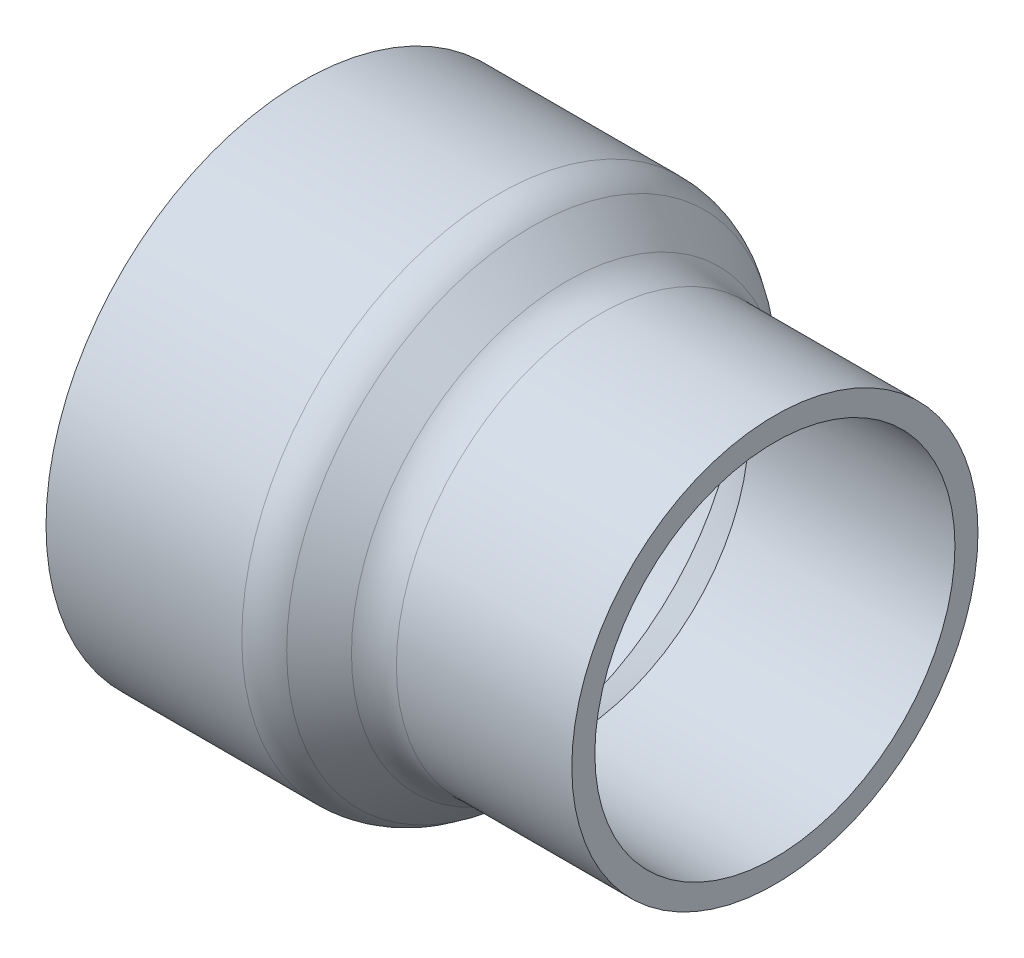
ISO-10303-21;
HEADER;
FILE_DESCRIPTION(('STEP AP214'),'2;1');
FILE_NAME('part.step','',(''),(''),'','','');
FILE_SCHEMA(('AUTOMOTIVE_DESIGN { 1 0 10303 214 1 1 1 1 }'));
ENDSEC;
DATA;
#1=APPLICATION_CONTEXT('core data for automotive mechanical design processes');
#2=APPLICATION_PROTOCOL_DEFINITION('international standard','automotive_design',2000,#1);
#3=PRODUCT_CONTEXT('',#1,'mechanical');
#4=PRODUCT('Part','Part','',(#3));
#5=PRODUCT_RELATED_PRODUCT_CATEGORY('part','',(#4));
#6=PRODUCT_DEFINITION_FORMATION('','',#4);
#7=PRODUCT_DEFINITION_CONTEXT('part definition',#1,'design');
#8=PRODUCT_DEFINITION('design','',#6,#7);
#9=PRODUCT_DEFINITION_SHAPE('','',#8);
#10=(LENGTH_UNIT() NAMED_UNIT(*) SI_UNIT(.MILLI.,.METRE.));
#11=(NAMED_UNIT(*) PLANE_ANGLE_UNIT() SI_UNIT($,.RADIAN.));
#12=(NAMED_UNIT(*) SI_UNIT($,.STERADIAN.) SOLID_ANGLE_UNIT());
#13=UNCERTAINTY_MEASURE_WITH_UNIT(LENGTH_MEASURE(1.E-05),#10,'distance_accuracy_value','');
#14=(GEOMETRIC_REPRESENTATION_CONTEXT(3) GLOBAL_UNCERTAINTY_ASSIGNED_CONTEXT((#13)) GLOBAL_UNIT_ASSIGNED_CONTEXT((#10,
#11,#12)) REPRESENTATION_CONTEXT('',''));
#15=CARTESIAN_POINT('',(0.,0.,0.));
#16=DIRECTION('',(0.,0.,1.));
#17=DIRECTION('',(1.,0.,0.));
#18=AXIS2_PLACEMENT_3D('',#15,#16,#17);
#19=CARTESIAN_POINT('',(-58.5597,0.,0.));
#20=DIRECTION('',(-1.,0.,0.));
#21=DIRECTION('',(0.,0.,1.));
#22=AXIS2_PLACEMENT_3D('',#19,#20,#21);
#23=CYLINDRICAL_SURFACE('',#22,63.6397);
#24=CARTESIAN_POINT('',(-10.0039202483172,0.,0.));
#25=DIRECTION('',(1.,0.,0.));
#26=DIRECTION('',(0.,0.,-1.));
#27=AXIS2_PLACEMENT_3D('',#24,#25,#26);
#28=CIRCLE('',#27,63.6397);
#29=CARTESIAN_POINT('',(-10.0039202483172,0.,-63.6397));
#30=VERTEX_POINT('',#29);
#31=EDGE_CURVE('E50',#30,#30,#28,.F.);
#32=ORIENTED_EDGE('',*,*,#31,.T.);
#33=EDGE_LOOP('',(#32));
#34=FACE_BOUND('',#33,.T.);
#35=CARTESIAN_POINT('',(-58.5597,0.,0.));
#36=DIRECTION('',(-1.,0.,0.));
#37=DIRECTION('',(0.,0.,1.));
#38=AXIS2_PLACEMENT_3D('',#35,#36,#37);
#39=CIRCLE('',#38,63.6397);
#40=CARTESIAN_POINT('',(-58.5597,0.,63.6397));
#41=VERTEX_POINT('',#40);
#42=EDGE_CURVE('E55',#41,#41,#39,.T.);
#43=ORIENTED_EDGE('',*,*,#42,.F.);
#44=EDGE_LOOP('',(#43));
#45=FACE_BOUND('',#44,.T.);
#46=ADVANCED_FACE('F35',(#34,#45),#23,.T.);
#47=CARTESIAN_POINT('',(-58.5597,-63.6397,0.));
#48=DIRECTION('',(-1.,0.,0.));
#49=DIRECTION('',(0.,0.,1.));
#50=AXIS2_PLACEMENT_3D('',#47,#48,#49);
#51=PLANE('',#50);
#52=ORIENTED_EDGE('',*,*,#42,.T.);
#53=EDGE_LOOP('',(#52));
#54=FACE_BOUND('',#53,.T.);
#55=CARTESIAN_POINT('',(-58.5597,0.,0.));
#56=DIRECTION('',(-1.,0.,0.));
#57=DIRECTION('',(0.,0.,1.));
#58=AXIS2_PLACEMENT_3D('',#55,#56,#57);
#59=CIRCLE('',#58,57.3786);
#60=CARTESIAN_POINT('',(-58.5597,0.,57.3786));
#61=VERTEX_POINT('',#60);
#62=EDGE_CURVE('E58',#61,#61,#59,.T.);
#63=ORIENTED_EDGE('',*,*,#62,.F.);
#64=EDGE_LOOP('',(#63));
#65=FACE_BOUND('',#64,.T.);
#66=ADVANCED_FACE('F94',(#54,#65),#51,.T.);
#67=CARTESIAN_POINT('',(-7.25169999999999,0.,0.));
#68=DIRECTION('',(-1.,0.,0.));
#69=DIRECTION('',(0.,0.,1.));
#70=AXIS2_PLACEMENT_3D('',#67,#68,#69);
#71=CONICAL_SURFACE('',#70,57.0357,0.00668306881884247);
#72=ORIENTED_EDGE('',*,*,#62,.T.);
#73=EDGE_LOOP('',(#72));
#74=FACE_BOUND('',#73,.T.);
#75=CARTESIAN_POINT('',(-7.25169999999999,0.,0.));
#76=DIRECTION('',(-1.,0.,0.));
#77=DIRECTION('',(0.,0.,1.));
#78=AXIS2_PLACEMENT_3D('',#75,#76,#77);
#79=CIRCLE('',#78,57.0357);
#80=CARTESIAN_POINT('',(-7.25169999999999,0.,57.0357));
#81=VERTEX_POINT('',#80);
#82=EDGE_CURVE('E61',#81,#81,#79,.T.);
#83=ORIENTED_EDGE('',*,*,#82,.F.);
#84=EDGE_LOOP('',(#83));
#85=FACE_BOUND('',#84,.T.);
#86=ADVANCED_FACE('F100',(#74,#85),#71,.F.);
#87=CARTESIAN_POINT('',(7.80462682951065,0.,0.));
#88=DIRECTION('',(-1.,0.,0.));
#89=DIRECTION('',(0.,0.,1.));
#90=AXIS2_PLACEMENT_3D('',#87,#88,#89);
#91=CONICAL_SURFACE('',#90,44.4019417104732,0.698131700797726);
#92=ORIENTED_EDGE('',*,*,#82,.T.);
#93=EDGE_LOOP('',(#92));
#94=FACE_BOUND('',#93,.T.);
#95=CARTESIAN_POINT('',(7.80462682951065,0.,0.));
#96=DIRECTION('',(-1.,0.,0.));
#97=DIRECTION('',(0.,0.,1.));
#98=AXIS2_PLACEMENT_3D('',#95,#96,#97);
#99=CIRCLE('',#98,44.4019417104732);
#100=CARTESIAN_POINT('',(7.80462682951065,0.,44.4019417104732));
#101=VERTEX_POINT('',#100);
#102=EDGE_CURVE('E64',#101,#101,#99,.T.);
#103=ORIENTED_EDGE('',*,*,#102,.F.);
#104=EDGE_LOOP('',(#103));
#105=FACE_BOUND('',#104,.T.);
#106=ADVANCED_FACE('F149',(#94,#105),#91,.F.);
#107=CARTESIAN_POINT('',(7.75969999999999,0.,0.));
#108=DIRECTION('',(1.,0.,0.));
#109=DIRECTION('',(0.,0.,-1.));
#110=AXIS2_PLACEMENT_3D('',#107,#108,#109);
#111=CONICAL_SURFACE('',#110,44.3484,0.872664625997168);
#112=ORIENTED_EDGE('',*,*,#102,.T.);
#113=EDGE_LOOP('',(#112));
#114=FACE_BOUND('',#113,.T.);
#115=CARTESIAN_POINT('',(7.75969999999999,0.,0.));
#116=DIRECTION('',(-1.,0.,0.));
#117=DIRECTION('',(0.,0.,1.));
#118=AXIS2_PLACEMENT_3D('',#115,#116,#117);
#119=CIRCLE('',#118,44.3484);
#120=CARTESIAN_POINT('',(7.75969999999999,0.,44.3484));
#121=VERTEX_POINT('',#120);
#122=EDGE_CURVE('E67',#121,#121,#119,.T.);
#123=ORIENTED_EDGE('',*,*,#122,.F.);
#124=EDGE_LOOP('',(#123));
#125=FACE_BOUND('',#124,.T.);
#126=ADVANCED_FACE('F90',(#114,#125),#111,.T.);
#127=CARTESIAN_POINT('',(58.5597,0.,0.));
#128=DIRECTION('',(1.,0.,0.));
#129=DIRECTION('',(0.,0.,-1.));
#130=AXIS2_PLACEMENT_3D('',#127,#128,#129);
#131=CONICAL_SURFACE('',#130,44.6532,0.00599992800155518);
#132=ORIENTED_EDGE('',*,*,#122,.T.);
#133=EDGE_LOOP('',(#132));
#134=FACE_BOUND('',#133,.T.);
#135=CARTESIAN_POINT('',(58.5597,0.,0.));
#136=DIRECTION('',(-1.,0.,0.));
#137=DIRECTION('',(0.,0.,1.));
#138=AXIS2_PLACEMENT_3D('',#135,#136,#137);
#139=CIRCLE('',#138,44.6532);
#140=CARTESIAN_POINT('',(58.5597,0.,44.6532));
#141=VERTEX_POINT('',#140);
#142=EDGE_CURVE('E70',#141,#141,#139,.T.);
#143=ORIENTED_EDGE('',*,*,#142,.F.);
#144=EDGE_LOOP('',(#143));
#145=FACE_BOUND('',#144,.T.);
#146=ADVANCED_FACE('F81',(#134,#145),#131,.F.);
#147=CARTESIAN_POINT('',(58.5597,-44.6532,0.));
#148=DIRECTION('',(1.,0.,0.));
#149=DIRECTION('',(0.,0.,-1.));
#150=AXIS2_PLACEMENT_3D('',#147,#148,#149);
#151=PLANE('',#150);
#152=ORIENTED_EDGE('',*,*,#142,.T.);
#153=EDGE_LOOP('',(#152));
#154=FACE_BOUND('',#153,.T.);
#155=CARTESIAN_POINT('',(58.5597,0.,0.));
#156=DIRECTION('',(-1.,0.,0.));
#157=DIRECTION('',(0.,0.,1.));
#158=AXIS2_PLACEMENT_3D('',#155,#156,#157);
#159=CIRCLE('',#158,50.3682);
#160=CARTESIAN_POINT('',(58.5597,0.,50.3682));
#161=VERTEX_POINT('',#160);
#162=EDGE_CURVE('E73',#161,#161,#159,.T.);
#163=ORIENTED_EDGE('',*,*,#162,.F.);
#164=EDGE_LOOP('',(#163));
#165=FACE_BOUND('',#164,.T.);
#166=ADVANCED_FACE('F79',(#154,#165),#151,.T.);
#167=CARTESIAN_POINT('',(-58.5597,0.,0.));
#168=DIRECTION('',(-1.,0.,0.));
#169=DIRECTION('',(0.,0.,1.));
#170=AXIS2_PLACEMENT_3D('',#167,#168,#169);
#171=CYLINDRICAL_SURFACE('',#170,50.3682);
#172=CARTESIAN_POINT('',(15.0572815061585,0.,0.));
#173=DIRECTION('',(-1.,0.,0.));
#174=DIRECTION('',(0.,0.,1.));
#175=AXIS2_PLACEMENT_3D('',#172,#173,#174);
#176=CIRCLE('',#175,50.3682);
#177=CARTESIAN_POINT('',(15.0572815061585,0.,50.3682));
#178=VERTEX_POINT('',#177);
#179=EDGE_CURVE('E10',#178,#178,#176,.F.);
#180=ORIENTED_EDGE('',*,*,#179,.T.);
#181=EDGE_LOOP('',(#180));
#182=FACE_BOUND('',#181,.T.);
#183=ORIENTED_EDGE('',*,*,#162,.T.);
#184=EDGE_LOOP('',(#183));
#185=FACE_BOUND('',#184,.T.);
#186=ADVANCED_FACE('F77',(#182,#185),#171,.T.);
#187=CARTESIAN_POINT('',(-5.38149827313646,0.,0.));
#188=DIRECTION('',(-1.,0.,0.));
#189=DIRECTION('',(0.,0.,1.));
#190=AXIS2_PLACEMENT_3D('',#187,#188,#189);
#191=CONICAL_SURFACE('',#190,63.6397,0.698131700797726);
#192=CARTESIAN_POINT('',(-1.8405176052982,0.,0.));
#193=DIRECTION('',(1.,0.,0.));
#194=DIRECTION('',(0.,0.,-1.));
#195=AXIS2_PLACEMENT_3D('',#192,#193,#194);
#196=CIRCLE('',#195,60.6684644276111);
#197=CARTESIAN_POINT('',(-1.8405176052982,0.,-60.6684644276111));
#198=VERTEX_POINT('',#197);
#199=EDGE_CURVE('E42',#198,#198,#196,.T.);
#200=ORIENTED_EDGE('',*,*,#199,.T.);
#201=EDGE_LOOP('',(#200));
#202=FACE_BOUND('',#201,.T.);
#203=CARTESIAN_POINT('',(6.89387886313952,0.,0.));
#204=DIRECTION('',(-1.,0.,0.));
#205=DIRECTION('',(0.,0.,1.));
#206=AXIS2_PLACEMENT_3D('',#203,#204,#205);
#207=CIRCLE('',#206,53.3394355723889);
#208=CARTESIAN_POINT('',(6.89387886313952,0.,53.3394355723889));
#209=VERTEX_POINT('',#208);
#210=EDGE_CURVE('E46',#209,#209,#207,.T.);
#211=ORIENTED_EDGE('',*,*,#210,.T.);
#212=EDGE_LOOP('',(#211));
#213=FACE_BOUND('',#212,.T.);
#214=ADVANCED_FACE('F88',(#202,#213),#191,.T.);
#215=CARTESIAN_POINT('',(-10.0039202483172,0.,0.));
#216=DIRECTION('',(1.,0.,0.));
#217=DIRECTION('',(0.,0.,-1.));
#218=AXIS2_PLACEMENT_3D('',#215,#216,#217);
#219=TOROIDAL_SURFACE('',#218,50.9397,12.7);
#220=ORIENTED_EDGE('',*,*,#199,.F.);
#221=EDGE_LOOP('',(#220));
#222=FACE_BOUND('',#221,.T.);
#223=ORIENTED_EDGE('',*,*,#31,.F.);
#224=EDGE_LOOP('',(#223));
#225=FACE_BOUND('',#224,.T.);
#226=ADVANCED_FACE('F105',(#222,#225),#219,.T.);
#227=CARTESIAN_POINT('',(15.0572815061585,0.,0.));
#228=DIRECTION('',(-1.,0.,0.));
#229=DIRECTION('',(0.,0.,1.));
#230=AXIS2_PLACEMENT_3D('',#227,#228,#229);
#231=TOROIDAL_SURFACE('',#230,63.0682,12.7);
#232=ORIENTED_EDGE('',*,*,#179,.F.);
#233=EDGE_LOOP('',(#232));
#234=FACE_BOUND('',#233,.T.);
#235=ORIENTED_EDGE('',*,*,#210,.F.);
#236=EDGE_LOOP('',(#235));
#237=FACE_BOUND('',#236,.T.);
#238=ADVANCED_FACE('F37',(#234,#237),#231,.F.);
#239=CLOSED_SHELL('',(#46,#66,#86,#106,#126,#146,#166,#186,#214,#226,#238));
#240=MANIFOLD_SOLID_BREP('B2',#239);
#241=ADVANCED_BREP_SHAPE_REPRESENTATION('',(#18,#240),#14);
#242=SHAPE_DEFINITION_REPRESENTATION(#9,#241);
ENDSEC;
END-ISO-10303-21;
